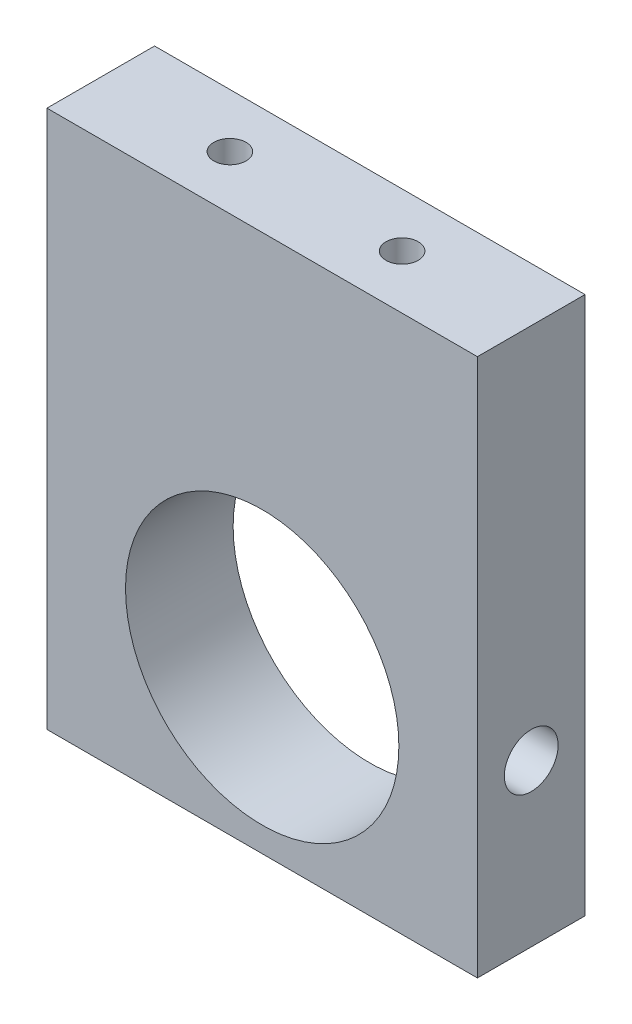
ISO-10303-21;
HEADER;
FILE_DESCRIPTION(('STEP AP214'),'2;1');
FILE_NAME('part.step','',(''),(''),'','','');
FILE_SCHEMA(('AUTOMOTIVE_DESIGN { 1 0 10303 214 1 1 1 1 }'));
ENDSEC;
DATA;
#1=APPLICATION_CONTEXT('core data for automotive mechanical design processes');
#2=APPLICATION_PROTOCOL_DEFINITION('international standard','automotive_design',2000,#1);
#3=PRODUCT_CONTEXT('',#1,'mechanical');
#4=PRODUCT('Part','Part','',(#3));
#5=PRODUCT_RELATED_PRODUCT_CATEGORY('part','',(#4));
#6=PRODUCT_DEFINITION_FORMATION('','',#4);
#7=PRODUCT_DEFINITION_CONTEXT('part definition',#1,'design');
#8=PRODUCT_DEFINITION('design','',#6,#7);
#9=PRODUCT_DEFINITION_SHAPE('','',#8);
#10=(LENGTH_UNIT() NAMED_UNIT(*) SI_UNIT(.MILLI.,.METRE.));
#11=(NAMED_UNIT(*) PLANE_ANGLE_UNIT() SI_UNIT($,.RADIAN.));
#12=(NAMED_UNIT(*) SI_UNIT($,.STERADIAN.) SOLID_ANGLE_UNIT());
#13=UNCERTAINTY_MEASURE_WITH_UNIT(LENGTH_MEASURE(1.E-05),#10,'distance_accuracy_value','');
#14=(GEOMETRIC_REPRESENTATION_CONTEXT(3) GLOBAL_UNCERTAINTY_ASSIGNED_CONTEXT((#13)) GLOBAL_UNIT_ASSIGNED_CONTEXT((#10,
#11,#12)) REPRESENTATION_CONTEXT('',''));
#15=CARTESIAN_POINT('',(0.,0.,0.));
#16=DIRECTION('',(0.,0.,1.));
#17=DIRECTION('',(1.,0.,0.));
#18=AXIS2_PLACEMENT_3D('',#15,#16,#17);
#19=CARTESIAN_POINT('',(-24.0858517274631,31.8330140808314,5.));
#20=DIRECTION('',(1.,0.,0.));
#21=DIRECTION('',(0.,1.,0.));
#22=AXIS2_PLACEMENT_3D('',#19,#20,#21);
#23=PLANE('',#22);
#24=DIRECTION('',(0.,-1.,0.));
#25=VECTOR('',#24,1.);
#26=CARTESIAN_POINT('',(-24.0858517274631,31.8330140808314,0.));
#27=LINE('',#26,#25);
#28=CARTESIAN_POINT('',(-24.0858517274631,31.8330140808314,0.));
#29=VERTEX_POINT('',#28);
#30=CARTESIAN_POINT('',(-24.0858517274631,6.83301408083139,0.));
#31=VERTEX_POINT('',#30);
#32=EDGE_CURVE('E98',#29,#31,#27,.T.);
#33=ORIENTED_EDGE('',*,*,#32,.T.);
#34=DIRECTION('',(0.,0.,-1.));
#35=VECTOR('',#34,1.);
#36=CARTESIAN_POINT('',(-24.0858517274631,6.83301408083139,5.));
#37=LINE('',#36,#35);
#38=CARTESIAN_POINT('',(-24.0858517274631,6.83301408083139,5.));
#39=VERTEX_POINT('',#38);
#40=EDGE_CURVE('E11',#39,#31,#37,.T.);
#41=ORIENTED_EDGE('',*,*,#40,.F.);
#42=DIRECTION('',(0.,-1.,0.));
#43=VECTOR('',#42,1.);
#44=CARTESIAN_POINT('',(-24.0858517274631,31.8330140808314,5.));
#45=LINE('',#44,#43);
#46=CARTESIAN_POINT('',(-24.0858517274631,31.8330140808314,5.));
#47=VERTEX_POINT('',#46);
#48=EDGE_CURVE('E86',#47,#39,#45,.T.);
#49=ORIENTED_EDGE('',*,*,#48,.F.);
#50=DIRECTION('',(0.,0.,-1.));
#51=VECTOR('',#50,1.);
#52=CARTESIAN_POINT('',(-24.0858517274631,31.8330140808314,5.));
#53=LINE('',#52,#51);
#54=EDGE_CURVE('E94',#47,#29,#53,.T.);
#55=ORIENTED_EDGE('',*,*,#54,.T.);
#56=EDGE_LOOP('',(#33,#41,#49,#55));
#57=FACE_BOUND('',#56,.T.);
#58=ADVANCED_FACE('F35',(#57),#23,.F.);
#59=CARTESIAN_POINT('',(-24.0858517274631,6.83301408083139,5.));
#60=DIRECTION('',(0.,1.,0.));
#61=DIRECTION('',(0.,0.,1.));
#62=AXIS2_PLACEMENT_3D('',#59,#60,#61);
#63=PLANE('',#62);
#64=DIRECTION('',(1.,0.,0.));
#65=VECTOR('',#64,1.);
#66=CARTESIAN_POINT('',(-24.0858517274631,6.83301408083139,0.));
#67=LINE('',#66,#65);
#68=CARTESIAN_POINT('',(-4.08585172746314,6.83301408083139,0.));
#69=VERTEX_POINT('',#68);
#70=EDGE_CURVE('E90',#31,#69,#67,.T.);
#71=ORIENTED_EDGE('',*,*,#70,.T.);
#72=DIRECTION('',(0.,0.,-1.));
#73=VECTOR('',#72,1.);
#74=CARTESIAN_POINT('',(-4.08585172746314,6.83301408083139,5.));
#75=LINE('',#74,#73);
#76=CARTESIAN_POINT('',(-4.08585172746314,6.83301408083139,5.));
#77=VERTEX_POINT('',#76);
#78=EDGE_CURVE('E43',#77,#69,#75,.T.);
#79=ORIENTED_EDGE('',*,*,#78,.F.);
#80=DIRECTION('',(1.,0.,0.));
#81=VECTOR('',#80,1.);
#82=CARTESIAN_POINT('',(-24.0858517274631,6.83301408083139,5.));
#83=LINE('',#82,#81);
#84=EDGE_CURVE('E81',#39,#77,#83,.T.);
#85=ORIENTED_EDGE('',*,*,#84,.F.);
#86=ORIENTED_EDGE('',*,*,#40,.T.);
#87=EDGE_LOOP('',(#71,#79,#85,#86));
#88=FACE_BOUND('',#87,.T.);
#89=ADVANCED_FACE('F89',(#88),#63,.F.);
#90=CARTESIAN_POINT('',(-4.08585172746314,31.8330140808314,5.));
#91=DIRECTION('',(-1.,0.,0.));
#92=DIRECTION('',(0.,-1.,0.));
#93=AXIS2_PLACEMENT_3D('',#90,#91,#92);
#94=PLANE('',#93);
#95=CARTESIAN_POINT('',(-4.08585172746314,14.3330140808314,2.5));
#96=DIRECTION('',(1.,0.,0.));
#97=DIRECTION('',(0.,1.,0.));
#98=AXIS2_PLACEMENT_3D('',#95,#96,#97);
#99=CIRCLE('',#98,1.25);
#100=CARTESIAN_POINT('',(-4.08585172746314,15.5830140808314,2.5));
#101=VERTEX_POINT('',#100);
#102=EDGE_CURVE('E127',#101,#101,#99,.T.);
#103=ORIENTED_EDGE('',*,*,#102,.F.);
#104=EDGE_LOOP('',(#103));
#105=FACE_BOUND('',#104,.T.);
#106=DIRECTION('',(0.,1.,0.));
#107=VECTOR('',#106,1.);
#108=CARTESIAN_POINT('',(-4.08585172746314,31.8330140808314,0.));
#109=LINE('',#108,#107);
#110=CARTESIAN_POINT('',(-4.08585172746314,31.8330140808314,0.));
#111=VERTEX_POINT('',#110);
#112=EDGE_CURVE('E68',#69,#111,#109,.T.);
#113=ORIENTED_EDGE('',*,*,#112,.T.);
#114=DIRECTION('',(0.,0.,-1.));
#115=VECTOR('',#114,1.);
#116=CARTESIAN_POINT('',(-4.08585172746314,31.8330140808314,5.));
#117=LINE('',#116,#115);
#118=CARTESIAN_POINT('',(-4.08585172746314,31.8330140808314,5.));
#119=VERTEX_POINT('',#118);
#120=EDGE_CURVE('E91',#119,#111,#117,.T.);
#121=ORIENTED_EDGE('',*,*,#120,.F.);
#122=DIRECTION('',(0.,1.,0.));
#123=VECTOR('',#122,1.);
#124=CARTESIAN_POINT('',(-4.08585172746314,31.8330140808314,5.));
#125=LINE('',#124,#123);
#126=EDGE_CURVE('E84',#77,#119,#125,.T.);
#127=ORIENTED_EDGE('',*,*,#126,.F.);
#128=ORIENTED_EDGE('',*,*,#78,.T.);
#129=EDGE_LOOP('',(#113,#121,#127,#128));
#130=FACE_BOUND('',#129,.T.);
#131=ADVANCED_FACE('F92',(#105,#130),#94,.F.);
#132=CARTESIAN_POINT('',(-24.0858517274631,31.8330140808314,5.));
#133=DIRECTION('',(0.,-1.,0.));
#134=DIRECTION('',(0.,0.,-1.));
#135=AXIS2_PLACEMENT_3D('',#132,#133,#134);
#136=PLANE('',#135);
#137=CARTESIAN_POINT('',(-18.0858517274631,31.8330140808314,2.5));
#138=DIRECTION('',(0.,1.,0.));
#139=DIRECTION('',(0.,0.,1.));
#140=AXIS2_PLACEMENT_3D('',#137,#138,#139);
#141=CIRCLE('',#140,0.750000000000002);
#142=CARTESIAN_POINT('',(-18.0858517274631,31.8330140808314,3.25));
#143=VERTEX_POINT('',#142);
#144=EDGE_CURVE('E124',#143,#143,#141,.T.);
#145=ORIENTED_EDGE('',*,*,#144,.F.);
#146=EDGE_LOOP('',(#145));
#147=FACE_BOUND('',#146,.T.);
#148=CARTESIAN_POINT('',(-10.0858517274631,31.8330140808314,2.5));
#149=DIRECTION('',(0.,1.,0.));
#150=DIRECTION('',(0.,0.,1.));
#151=AXIS2_PLACEMENT_3D('',#148,#149,#150);
#152=CIRCLE('',#151,0.75);
#153=CARTESIAN_POINT('',(-10.0858517274631,31.8330140808314,3.25));
#154=VERTEX_POINT('',#153);
#155=EDGE_CURVE('E118',#154,#154,#152,.T.);
#156=ORIENTED_EDGE('',*,*,#155,.F.);
#157=EDGE_LOOP('',(#156));
#158=FACE_BOUND('',#157,.T.);
#159=DIRECTION('',(-1.,0.,0.));
#160=VECTOR('',#159,1.);
#161=CARTESIAN_POINT('',(-24.0858517274631,31.8330140808314,0.));
#162=LINE('',#161,#160);
#163=EDGE_CURVE('E74',#111,#29,#162,.T.);
#164=ORIENTED_EDGE('',*,*,#163,.T.);
#165=ORIENTED_EDGE('',*,*,#54,.F.);
#166=DIRECTION('',(-1.,0.,0.));
#167=VECTOR('',#166,1.);
#168=CARTESIAN_POINT('',(-24.0858517274631,31.8330140808314,5.));
#169=LINE('',#168,#167);
#170=EDGE_CURVE('E51',#119,#47,#169,.T.);
#171=ORIENTED_EDGE('',*,*,#170,.F.);
#172=ORIENTED_EDGE('',*,*,#120,.T.);
#173=EDGE_LOOP('',(#164,#165,#171,#172));
#174=FACE_BOUND('',#173,.T.);
#175=ADVANCED_FACE('F106',(#147,#158,#174),#136,.F.);
#176=CARTESIAN_POINT('',(0.,0.,5.));
#177=DIRECTION('',(0.,0.,1.));
#178=DIRECTION('',(1.,0.,0.));
#179=AXIS2_PLACEMENT_3D('',#176,#177,#178);
#180=PLANE('',#179);
#181=CARTESIAN_POINT('',(-14.0858517274631,14.3330140808314,5.));
#182=DIRECTION('',(0.,0.,1.));
#183=DIRECTION('',(1.,0.,0.));
#184=AXIS2_PLACEMENT_3D('',#181,#182,#183);
#185=CIRCLE('',#184,6.35);
#186=CARTESIAN_POINT('',(-7.73585172746314,14.3330140808314,5.));
#187=VERTEX_POINT('',#186);
#188=EDGE_CURVE('E114',#187,#187,#185,.T.);
#189=ORIENTED_EDGE('',*,*,#188,.F.);
#190=EDGE_LOOP('',(#189));
#191=FACE_BOUND('',#190,.T.);
#192=ORIENTED_EDGE('',*,*,#48,.T.);
#193=ORIENTED_EDGE('',*,*,#84,.T.);
#194=ORIENTED_EDGE('',*,*,#126,.T.);
#195=ORIENTED_EDGE('',*,*,#170,.T.);
#196=EDGE_LOOP('',(#192,#193,#194,#195));
#197=FACE_BOUND('',#196,.T.);
#198=ADVANCED_FACE('F82',(#191,#197),#180,.T.);
#199=CARTESIAN_POINT('',(0.,0.,0.));
#200=DIRECTION('',(0.,0.,1.));
#201=DIRECTION('',(1.,0.,0.));
#202=AXIS2_PLACEMENT_3D('',#199,#200,#201);
#203=PLANE('',#202);
#204=CARTESIAN_POINT('',(-14.0858517274631,14.3330140808314,0.));
#205=DIRECTION('',(0.,0.,1.));
#206=DIRECTION('',(1.,0.,0.));
#207=AXIS2_PLACEMENT_3D('',#204,#205,#206);
#208=CIRCLE('',#207,6.35);
#209=CARTESIAN_POINT('',(-7.73585172746314,14.3330140808314,0.));
#210=VERTEX_POINT('',#209);
#211=EDGE_CURVE('E101',#210,#210,#208,.F.);
#212=ORIENTED_EDGE('',*,*,#211,.F.);
#213=EDGE_LOOP('',(#212));
#214=FACE_BOUND('',#213,.T.);
#215=ORIENTED_EDGE('',*,*,#32,.F.);
#216=ORIENTED_EDGE('',*,*,#163,.F.);
#217=ORIENTED_EDGE('',*,*,#112,.F.);
#218=ORIENTED_EDGE('',*,*,#70,.F.);
#219=EDGE_LOOP('',(#215,#216,#217,#218));
#220=FACE_BOUND('',#219,.T.);
#221=ADVANCED_FACE('F109',(#214,#220),#203,.F.);
#222=CARTESIAN_POINT('',(-14.0858517274631,14.3330140808314,-0.00100000000000013));
#223=DIRECTION('',(0.,0.,1.));
#224=DIRECTION('',(1.,0.,0.));
#225=AXIS2_PLACEMENT_3D('',#222,#223,#224);
#226=CYLINDRICAL_SURFACE('',#225,6.35);
#227=CARTESIAN_POINT('',(-7.86009876095378,15.5830140808314,2.5));
#228=CARTESIAN_POINT('',(-7.86009738719004,15.5830114863958,2.43052072478716));
#229=CARTESIAN_POINT('',(-7.85892303748066,15.5772015680711,2.36100852278268));
#230=CARTESIAN_POINT('',(-7.85435915523564,15.5541338145195,2.22394892922571));
#231=CARTESIAN_POINT('',(-7.85096782278034,15.5368666772568,2.15640318077693));
#232=CARTESIAN_POINT('',(-7.8423686080821,15.4914392877183,2.02527928534145));
#233=CARTESIAN_POINT('',(-7.83716250351261,15.4632896925032,1.96169732718271));
#234=CARTESIAN_POINT('',(-7.82552245385917,15.396925386706,1.84016087373147));
#235=CARTESIAN_POINT('',(-7.81908858431013,15.3587112952597,1.7822060325767));
#236=CARTESIAN_POINT('',(-7.80561944550612,15.2727445442956,1.67277139265359));
#237=CARTESIAN_POINT('',(-7.7985777569998,15.2248804307573,1.6213799231663));
#238=CARTESIAN_POINT('',(-7.78474295025924,15.1212131462349,1.52730157363886));
#239=CARTESIAN_POINT('',(-7.77794984918569,15.0654094284518,1.48461529361628));
#240=CARTESIAN_POINT('',(-7.76530850189341,14.9468632933085,1.40881737579065));
#241=CARTESIAN_POINT('',(-7.75946870583139,14.8840663354926,1.37578950786562));
#242=CARTESIAN_POINT('',(-7.74946399930395,14.7536803761392,1.32078628893939));
#243=CARTESIAN_POINT('',(-7.74529893700185,14.686091809678,1.29880993592742));
#244=CARTESIAN_POINT('',(-7.73915833545984,14.5489575586243,1.26680807132439));
#245=CARTESIAN_POINT('',(-7.73715550367939,14.4794479087003,1.25663346814221));
#246=CARTESIAN_POINT('',(-7.73547081662483,14.3396812958725,1.24805892139546));
#247=CARTESIAN_POINT('',(-7.73578874439961,14.269424403436,1.24965787720577));
#248=CARTESIAN_POINT('',(-7.73868855986688,14.1311816046894,1.26447165403007));
#249=CARTESIAN_POINT('',(-7.74123914901677,14.0631777391728,1.2775258954576));
#250=CARTESIAN_POINT('',(-7.74828245495737,13.9303450320499,1.31462516827592));
#251=CARTESIAN_POINT('',(-7.75277524771808,13.8655163147511,1.33867062959436));
#252=CARTESIAN_POINT('',(-7.76324991967037,13.7404140775262,1.39721963295748));
#253=CARTESIAN_POINT('',(-7.76924076323898,13.6801709360595,1.43178641564595));
#254=CARTESIAN_POINT('',(-7.78205056885238,13.5662805802058,1.51035009323126));
#255=CARTESIAN_POINT('',(-7.78886962330892,13.5126341032212,1.55434804087706));
#256=CARTESIAN_POINT('',(-7.80271800146374,13.4125073369289,1.65140705733161));
#257=CARTESIAN_POINT('',(-7.80974893132861,13.366163386101,1.70460864895141));
#258=CARTESIAN_POINT('',(-7.82311916612867,13.283033627141,1.81809919349832));
#259=CARTESIAN_POINT('',(-7.82945845878441,13.2462479886929,1.87838827221846));
#260=CARTESIAN_POINT('',(-7.84073061089961,13.183234152781,2.00453432825388));
#261=CARTESIAN_POINT('',(-7.84566060191331,13.1570274432891,2.07040231260942));
#262=CARTESIAN_POINT('',(-7.85351342466373,13.1160925150379,2.20572592335147));
#263=CARTESIAN_POINT('',(-7.85643650910605,13.1013628510808,2.27518109686176));
#264=CARTESIAN_POINT('',(-7.85989409161326,13.0840026866802,2.41447343121965));
#265=CARTESIAN_POINT('',(-7.86046740256251,13.08117556199,2.4842851497232));
#266=CARTESIAN_POINT('',(-7.85926462616787,13.0871721524131,2.62338278157181));
#267=CARTESIAN_POINT('',(-7.85748866762485,13.0959952287932,2.6926687235336));
#268=CARTESIAN_POINT('',(-7.85182375515767,13.1248724379455,2.82809086488165));
#269=CARTESIAN_POINT('',(-7.8479544806375,13.1448220228189,2.89425025564457));
#270=CARTESIAN_POINT('',(-7.83855608460292,13.1952743873262,3.02228751632132));
#271=CARTESIAN_POINT('',(-7.83302683002147,13.2257780130212,3.08416504250356));
#272=CARTESIAN_POINT('',(-7.82084397853648,13.2969195813248,3.20274398202248));
#273=CARTESIAN_POINT('',(-7.81417704160987,13.3376808598253,3.25937000273833));
#274=CARTESIAN_POINT('',(-7.8005068588961,13.428015775275,3.36504992121367));
#275=CARTESIAN_POINT('',(-7.79350357967876,13.4775902895294,3.41410306422919));
#276=CARTESIAN_POINT('',(-7.77982415769212,13.5850259644304,3.50398746886068));
#277=CARTESIAN_POINT('',(-7.77315440905889,13.642999144765,3.54468596692148));
#278=CARTESIAN_POINT('',(-7.76100380239393,13.7650742398836,3.61576532367679));
#279=CARTESIAN_POINT('',(-7.75552289545991,13.8291759024198,3.64614660679285));
#280=CARTESIAN_POINT('',(-7.74639487482971,13.9613347612764,3.6955342586328));
#281=CARTESIAN_POINT('',(-7.74273759912525,14.0293676258131,3.71460377660668));
#282=CARTESIAN_POINT('',(-7.73762539123069,14.1677498687956,3.74102705611688));
#283=CARTESIAN_POINT('',(-7.73617020246431,14.2380989763881,3.7483821825614));
#284=CARTESIAN_POINT('',(-7.73563194696328,14.3778473358458,3.75111640638569));
#285=CARTESIAN_POINT('',(-7.73650929741019,14.4472426033433,3.74669534143294));
#286=CARTESIAN_POINT('',(-7.74045456729505,14.5842807520506,3.72644300151579));
#287=CARTESIAN_POINT('',(-7.74352246093575,14.6519236538877,3.71061186092372));
#288=CARTESIAN_POINT('',(-7.75150328003945,14.7834172785796,3.6680764076749));
#289=CARTESIAN_POINT('',(-7.75641224856377,14.847275796591,3.6413954038451));
#290=CARTESIAN_POINT('',(-7.76754592130616,14.9696386350794,3.57794251401758));
#291=CARTESIAN_POINT('',(-7.77377072549129,15.0281425482705,3.54116986127067));
#292=CARTESIAN_POINT('',(-7.78697402351,15.139125570582,3.45789986078626));
#293=CARTESIAN_POINT('',(-7.79396279770278,15.1914959260424,3.41125917902533));
#294=CARTESIAN_POINT('',(-7.80784432792167,15.2877355539333,3.30987234606098));
#295=CARTESIAN_POINT('',(-7.81473706086423,15.3316028142701,3.2551242817946));
#296=CARTESIAN_POINT('',(-7.82772466644151,15.4100221281586,3.13839591744981));
#297=CARTESIAN_POINT('',(-7.83381052116832,15.4444728344383,3.07634648790356));
#298=CARTESIAN_POINT('',(-7.84438560191188,15.5024048558145,2.94723811598685));
#299=CARTESIAN_POINT('',(-7.84887629060238,15.5258962262067,2.88018383141724));
#300=CARTESIAN_POINT('',(-7.85484583835341,15.5566308457634,2.76080469965143));
#301=CARTESIAN_POINT('',(-7.85680360818664,15.5665070501351,2.70916553191219));
#302=CARTESIAN_POINT('',(-7.85943056778305,15.5796995416861,2.60502382912632));
#303=CARTESIAN_POINT('',(-7.86009979942012,15.5830160420376,2.55252132219173));
#304=CARTESIAN_POINT('',(-7.86009876095378,15.5830140808314,2.5));
#305=B_SPLINE_CURVE_WITH_KNOTS('',3,(#227,#228,#229,#230,#231,#232,#233,#234,#235,#236,#237,
#238,#239,#240,#241,#242,#243,#244,#245,#246,#247,#248,#249,#250,#251,#252,#253,#254,#255,#256,
#257,#258,#259,#260,#261,#262,#263,#264,#265,#266,#267,#268,#269,#270,#271,#272,#273,#274,#275,
#276,#277,#278,#279,#280,#281,#282,#283,#284,#285,#286,#287,#288,#289,#290,#291,#292,#293,#294,
#295,#296,#297,#298,#299,#300,#301,#302,#303,#304),.UNSPECIFIED.,.T.,.F.,(4,2,2,2,2,2,2,2,2,2,2,
2,2,2,2,2,2,2,2,2,2,2,2,2,2,2,2,2,2,2,2,2,2,2,2,2,2,2,4),(0.,0.208245547253059,
0.416660374824381,0.624871619155636,0.83307005798413,1.04382718376135,1.25459883136701,
1.4671477374256,1.67967736877748,1.88949181939235,2.09928665621642,2.30618675357125,
2.51309494463054,2.72127221912449,2.929472743412,3.14118972183834,3.35291045851378,
3.56505910524068,3.77718103373994,3.98578471554464,4.1943769609331,4.40104145434087,
4.6077225187781,4.81701849712631,5.02633532132022,5.23875728413996,5.45117050745143,
5.66238646820456,5.8735778172235,6.08120825351501,6.28883624465787,6.49602052413561,
6.70322054954176,6.91366685640685,7.12416290071185,7.3368424318716,7.54932644188325,
7.70675017578223,7.86416879376244),.UNSPECIFIED.);
#306=CARTESIAN_POINT('',(-7.86009876095378,15.5830140808314,2.5));
#307=VERTEX_POINT('',#306);
#308=EDGE_CURVE('E132',#307,#307,#305,.T.);
#309=ORIENTED_EDGE('',*,*,#308,.F.);
#310=EDGE_LOOP('',(#309));
#311=FACE_BOUND('',#310,.T.);
#312=ORIENTED_EDGE('',*,*,#188,.T.);
#313=EDGE_LOOP('',(#312));
#314=FACE_BOUND('',#313,.T.);
#315=ORIENTED_EDGE('',*,*,#211,.T.);
#316=EDGE_LOOP('',(#315));
#317=FACE_BOUND('',#316,.T.);
#318=ADVANCED_FACE('F159',(#311,#314,#317),#226,.F.);
#319=CARTESIAN_POINT('',(-10.0858517274631,24.8330140808314,2.5));
#320=DIRECTION('',(0.,1.,0.));
#321=DIRECTION('',(0.,0.,1.));
#322=AXIS2_PLACEMENT_3D('',#319,#320,#321);
#323=CYLINDRICAL_SURFACE('',#322,0.75);
#324=CARTESIAN_POINT('',(-10.0858517274631,24.8330140808314,2.5));
#325=DIRECTION('',(0.,1.,0.));
#326=DIRECTION('',(0.,0.,1.));
#327=AXIS2_PLACEMENT_3D('',#324,#325,#326);
#328=CIRCLE('',#327,0.75);
#329=CARTESIAN_POINT('',(-10.0858517274631,24.8330140808314,3.25));
#330=VERTEX_POINT('',#329);
#331=EDGE_CURVE('E117',#330,#330,#328,.T.);
#332=ORIENTED_EDGE('',*,*,#331,.F.);
#333=EDGE_LOOP('',(#332));
#334=FACE_BOUND('',#333,.T.);
#335=ORIENTED_EDGE('',*,*,#155,.T.);
#336=EDGE_LOOP('',(#335));
#337=FACE_BOUND('',#336,.T.);
#338=ADVANCED_FACE('F155',(#334,#337),#323,.F.);
#339=CARTESIAN_POINT('',(-10.0858517274631,24.8330140808314,2.5));
#340=DIRECTION('',(0.,1.,0.));
#341=DIRECTION('',(0.,0.,1.));
#342=AXIS2_PLACEMENT_3D('',#339,#340,#341);
#343=PLANE('',#342);
#344=ORIENTED_EDGE('',*,*,#331,.T.);
#345=EDGE_LOOP('',(#344));
#346=FACE_BOUND('',#345,.T.);
#347=ADVANCED_FACE('F151',(#346),#343,.T.);
#348=CARTESIAN_POINT('',(-18.0858517274631,24.8330140808314,2.5));
#349=DIRECTION('',(0.,1.,0.));
#350=DIRECTION('',(0.,0.,1.));
#351=AXIS2_PLACEMENT_3D('',#348,#349,#350);
#352=CYLINDRICAL_SURFACE('',#351,0.750000000000002);
#353=CARTESIAN_POINT('',(-18.0858517274631,24.8330140808314,2.5));
#354=DIRECTION('',(0.,1.,0.));
#355=DIRECTION('',(0.,0.,1.));
#356=AXIS2_PLACEMENT_3D('',#353,#354,#355);
#357=CIRCLE('',#356,0.750000000000002);
#358=CARTESIAN_POINT('',(-18.0858517274631,24.8330140808314,3.25));
#359=VERTEX_POINT('',#358);
#360=EDGE_CURVE('E121',#359,#359,#357,.T.);
#361=ORIENTED_EDGE('',*,*,#360,.F.);
#362=EDGE_LOOP('',(#361));
#363=FACE_BOUND('',#362,.T.);
#364=ORIENTED_EDGE('',*,*,#144,.T.);
#365=EDGE_LOOP('',(#364));
#366=FACE_BOUND('',#365,.T.);
#367=ADVANCED_FACE('F147',(#363,#366),#352,.F.);
#368=CARTESIAN_POINT('',(-18.0858517274631,24.8330140808314,2.5));
#369=DIRECTION('',(0.,1.,0.));
#370=DIRECTION('',(0.,0.,1.));
#371=AXIS2_PLACEMENT_3D('',#368,#369,#370);
#372=PLANE('',#371);
#373=ORIENTED_EDGE('',*,*,#360,.T.);
#374=EDGE_LOOP('',(#373));
#375=FACE_BOUND('',#374,.T.);
#376=ADVANCED_FACE('F143',(#375),#372,.T.);
#377=CARTESIAN_POINT('',(-24.0868517274631,14.3330140808314,2.5));
#378=DIRECTION('',(1.,0.,0.));
#379=DIRECTION('',(0.,1.,0.));
#380=AXIS2_PLACEMENT_3D('',#377,#378,#379);
#381=CYLINDRICAL_SURFACE('',#380,1.25);
#382=ORIENTED_EDGE('',*,*,#102,.T.);
#383=EDGE_LOOP('',(#382));
#384=FACE_BOUND('',#383,.T.);
#385=ORIENTED_EDGE('',*,*,#308,.T.);
#386=EDGE_LOOP('',(#385));
#387=FACE_BOUND('',#386,.T.);
#388=ADVANCED_FACE('F138',(#384,#387),#381,.F.);
#389=CLOSED_SHELL('',(#58,#89,#131,#175,#198,#221,#318,#338,#347,#367,#376,#388));
#390=MANIFOLD_SOLID_BREP('B2',#389);
#391=ADVANCED_BREP_SHAPE_REPRESENTATION('',(#18,#390),#14);
#392=SHAPE_DEFINITION_REPRESENTATION(#9,#391);
ENDSEC;
END-ISO-10303-21;
